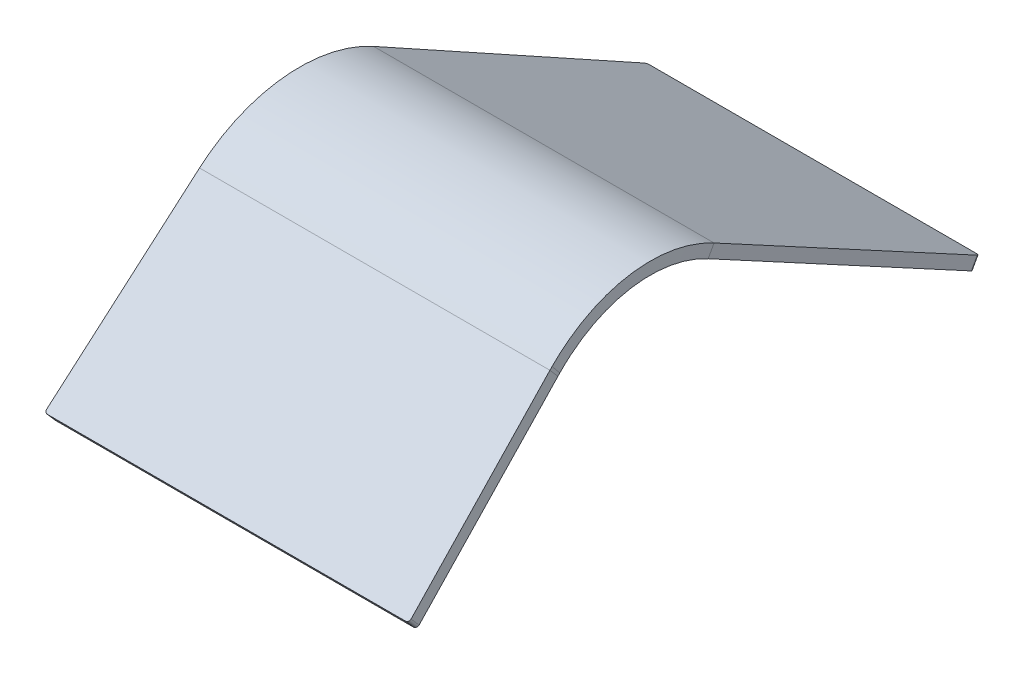
ISO-10303-21;
HEADER;
FILE_DESCRIPTION(('STEP AP214'),'2;1');
FILE_NAME('part.step','',(''),(''),'','','');
FILE_SCHEMA(('AUTOMOTIVE_DESIGN { 1 0 10303 214 1 1 1 1 }'));
ENDSEC;
DATA;
#1=APPLICATION_CONTEXT('core data for automotive mechanical design processes');
#2=APPLICATION_PROTOCOL_DEFINITION('international standard','automotive_design',2000,#1);
#3=PRODUCT_CONTEXT('',#1,'mechanical');
#4=PRODUCT('Part','Part','',(#3));
#5=PRODUCT_RELATED_PRODUCT_CATEGORY('part','',(#4));
#6=PRODUCT_DEFINITION_FORMATION('','',#4);
#7=PRODUCT_DEFINITION_CONTEXT('part definition',#1,'design');
#8=PRODUCT_DEFINITION('design','',#6,#7);
#9=PRODUCT_DEFINITION_SHAPE('','',#8);
#10=(LENGTH_UNIT() NAMED_UNIT(*) SI_UNIT(.MILLI.,.METRE.));
#11=(NAMED_UNIT(*) PLANE_ANGLE_UNIT() SI_UNIT($,.RADIAN.));
#12=(NAMED_UNIT(*) SI_UNIT($,.STERADIAN.) SOLID_ANGLE_UNIT());
#13=UNCERTAINTY_MEASURE_WITH_UNIT(LENGTH_MEASURE(1.E-05),#10,'distance_accuracy_value','');
#14=(GEOMETRIC_REPRESENTATION_CONTEXT(3) GLOBAL_UNCERTAINTY_ASSIGNED_CONTEXT((#13)) GLOBAL_UNIT_ASSIGNED_CONTEXT((#10,
#11,#12)) REPRESENTATION_CONTEXT('',''));
#15=CARTESIAN_POINT('',(0.,0.,0.));
#16=DIRECTION('',(0.,0.,1.));
#17=DIRECTION('',(1.,0.,0.));
#18=AXIS2_PLACEMENT_3D('',#15,#16,#17);
#19=CARTESIAN_POINT('',(150.,130.,235.));
#20=DIRECTION('',(0.,0.87503404241775,-0.484061385167266));
#21=DIRECTION('',(0.,0.484061385167266,0.87503404241775));
#22=AXIS2_PLACEMENT_3D('',#19,#20,#21);
#23=PLANE('',#22);
#24=DIRECTION('',(-1.,0.,0.));
#25=VECTOR('',#24,1.);
#26=CARTESIAN_POINT('',(150.,0.,0.));
#27=LINE('',#26,#25);
#28=CARTESIAN_POINT('',(65.7299312475215,0.,0.));
#29=VERTEX_POINT('',#28);
#30=CARTESIAN_POINT('',(-148.,0.,0.));
#31=VERTEX_POINT('',#30);
#32=EDGE_CURVE('E185',#29,#31,#27,.T.);
#33=ORIENTED_EDGE('',*,*,#32,.F.);
#34=CARTESIAN_POINT('',(65.7299312475215,0.968122770334512,1.75006808483551));
#35=DIRECTION('',(0.,0.87503404241775,-0.484061385167266));
#36=DIRECTION('',(0.,0.484061385167266,0.87503404241775));
#37=AXIS2_PLACEMENT_3D('',#34,#35,#36);
#38=CIRCLE('',#37,2.);
#39=CARTESIAN_POINT('',(67.7293180904833,0.944151944036353,1.70673620652723));
#40=VERTEX_POINT('',#39);
#41=EDGE_CURVE('E206',#29,#40,#38,.F.);
#42=ORIENTED_EDGE('',*,*,#41,.T.);
#43=DIRECTION('',(-0.024760110011603,-0.483912982344654,-0.874765775776874));
#44=VECTOR('',#43,1.);
#45=CARTESIAN_POINT('',(74.3790367037548,130.906626440031,236.638901641594));
#46=LINE('',#45,#44);
#47=CARTESIAN_POINT('',(72.7411209673421,98.8951091864612,178.771928144757));
#48=VERTEX_POINT('',#47);
#49=EDGE_CURVE('E156',#48,#40,#46,.T.);
#50=ORIENTED_EDGE('',*,*,#49,.F.);
#51=DIRECTION('',(-1.,0.,0.));
#52=VECTOR('',#51,1.);
#53=CARTESIAN_POINT('',(150.,98.8951091864612,178.771928144757));
#54=LINE('',#53,#52);
#55=CARTESIAN_POINT('',(-150.,98.8951091864612,178.771928144757));
#56=VERTEX_POINT('',#55);
#57=EDGE_CURVE('E256',#48,#56,#54,.T.);
#58=ORIENTED_EDGE('',*,*,#57,.T.);
#59=DIRECTION('',(0.,-0.484061385167266,-0.87503404241775));
#60=VECTOR('',#59,1.);
#61=CARTESIAN_POINT('',(-150.,130.,235.));
#62=LINE('',#61,#60);
#63=CARTESIAN_POINT('',(-150.,0.968122770334534,1.75006808483549));
#64=VERTEX_POINT('',#63);
#65=EDGE_CURVE('E264',#56,#64,#62,.T.);
#66=ORIENTED_EDGE('',*,*,#65,.T.);
#67=CARTESIAN_POINT('',(-148.,0.968122770334506,1.75006808483549));
#68=DIRECTION('',(0.,0.87503404241775,-0.484061385167266));
#69=DIRECTION('',(0.,0.484061385167266,0.87503404241775));
#70=AXIS2_PLACEMENT_3D('',#67,#68,#69);
#71=CIRCLE('',#70,2.);
#72=EDGE_CURVE('E204',#64,#31,#71,.F.);
#73=ORIENTED_EDGE('',*,*,#72,.T.);
#74=EDGE_LOOP('',(#33,#42,#50,#58,#66,#73));
#75=FACE_BOUND('',#74,.T.);
#76=ADVANCED_FACE('F47',(#75),#23,.F.);
#77=CARTESIAN_POINT('',(150.,7.00027233934195,-3.87249108133825));
#78=DIRECTION('',(0.,-0.48406138516728,-0.875034042417742));
#79=DIRECTION('',(0.,0.875034042417742,-0.48406138516728));
#80=AXIS2_PLACEMENT_3D('',#77,#78,#79);
#81=PLANE('',#80);
#82=DIRECTION('',(-1.,0.,0.));
#83=VECTOR('',#82,1.);
#84=CARTESIAN_POINT('',(150.,7.00027233934195,-3.87249108133825));
#85=LINE('',#84,#83);
#86=CARTESIAN_POINT('',(65.7299312475215,7.00027233934195,-3.87249108133825));
#87=VERTEX_POINT('',#86);
#88=CARTESIAN_POINT('',(-148.,7.00027233934195,-3.87249108133825));
#89=VERTEX_POINT('',#88);
#90=EDGE_CURVE('E181',#87,#89,#85,.T.);
#91=ORIENTED_EDGE('',*,*,#90,.F.);
#92=DIRECTION('',(0.,-0.875034042417742,0.48406138516728));
#93=VECTOR('',#92,1.);
#94=CARTESIAN_POINT('',(65.7299312475215,7.00027233934192,-3.87249108133823));
#95=LINE('',#94,#93);
#96=EDGE_CURVE('E201',#87,#29,#95,.T.);
#97=ORIENTED_EDGE('',*,*,#96,.T.);
#98=ORIENTED_EDGE('',*,*,#32,.T.);
#99=DIRECTION('',(0.,-0.875034042417742,0.48406138516728));
#100=VECTOR('',#99,1.);
#101=CARTESIAN_POINT('',(-148.,7.00027233934195,-3.87249108133825));
#102=LINE('',#101,#100);
#103=EDGE_CURVE('E199',#31,#89,#102,.F.);
#104=ORIENTED_EDGE('',*,*,#103,.T.);
#105=EDGE_LOOP('',(#91,#97,#98,#104));
#106=FACE_BOUND('',#105,.T.);
#107=ADVANCED_FACE('F309',(#106),#81,.T.);
#108=CARTESIAN_POINT('',(150.,137.000272339342,231.127508918662));
#109=DIRECTION('',(0.,0.87503404241775,-0.484061385167266));
#110=DIRECTION('',(0.,0.484061385167266,0.87503404241775));
#111=AXIS2_PLACEMENT_3D('',#108,#109,#110);
#112=PLANE('',#111);
#113=DIRECTION('',(-0.024760110011603,-0.483912982344654,-0.874765775776874));
#114=VECTOR('',#113,1.);
#115=CARTESIAN_POINT('',(74.3790367037548,137.906898779373,232.766410560256));
#116=LINE('',#115,#114);
#117=CARTESIAN_POINT('',(72.7411209673421,105.895381525803,174.899437063419));
#118=VERTEX_POINT('',#117);
#119=CARTESIAN_POINT('',(67.7293180904833,7.94442428337827,-2.16575487481105));
#120=VERTEX_POINT('',#119);
#121=EDGE_CURVE('E159',#118,#120,#116,.T.);
#122=ORIENTED_EDGE('',*,*,#121,.T.);
#123=CARTESIAN_POINT('',(65.7299312475215,7.96839510967646,-2.12242299650274));
#124=DIRECTION('',(0.,0.87503404241775,-0.484061385167266));
#125=DIRECTION('',(0.,0.484061385167266,0.87503404241775));
#126=AXIS2_PLACEMENT_3D('',#123,#124,#125);
#127=CIRCLE('',#126,2.);
#128=EDGE_CURVE('E211',#120,#87,#127,.T.);
#129=ORIENTED_EDGE('',*,*,#128,.T.);
#130=ORIENTED_EDGE('',*,*,#90,.T.);
#131=CARTESIAN_POINT('',(-148.,7.96839510967648,-2.12242299650277));
#132=DIRECTION('',(0.,0.87503404241775,-0.484061385167266));
#133=DIRECTION('',(0.,0.484061385167266,0.87503404241775));
#134=AXIS2_PLACEMENT_3D('',#131,#132,#133);
#135=CIRCLE('',#134,2.);
#136=CARTESIAN_POINT('',(-150.,7.96839510967642,-2.12242299650284));
#137=VERTEX_POINT('',#136);
#138=EDGE_CURVE('E209',#89,#137,#135,.T.);
#139=ORIENTED_EDGE('',*,*,#138,.T.);
#140=DIRECTION('',(0.,-0.484061385167266,-0.87503404241775));
#141=VECTOR('',#140,1.);
#142=CARTESIAN_POINT('',(-150.,137.000272339342,231.127508918662));
#143=LINE('',#142,#141);
#144=CARTESIAN_POINT('',(-150.,105.895381525803,174.899437063419));
#145=VERTEX_POINT('',#144);
#146=EDGE_CURVE('E179',#145,#137,#143,.T.);
#147=ORIENTED_EDGE('',*,*,#146,.F.);
#148=DIRECTION('',(-1.,0.,0.));
#149=VECTOR('',#148,1.);
#150=CARTESIAN_POINT('',(150.,105.895381525803,174.899437063419));
#151=LINE('',#150,#149);
#152=EDGE_CURVE('E172',#118,#145,#151,.T.);
#153=ORIENTED_EDGE('',*,*,#152,.F.);
#154=EDGE_LOOP('',(#122,#129,#130,#139,#147,#153));
#155=FACE_BOUND('',#154,.T.);
#156=ADVANCED_FACE('F177',(#155),#112,.T.);
#157=CARTESIAN_POINT('',(150.,18.3919772840282,223.305575580145));
#158=DIRECTION('',(-1.,0.,0.));
#159=DIRECTION('',(0.,0.,1.));
#160=AXIS2_PLACEMENT_3D('',#157,#158,#159);
#161=CYLINDRICAL_SURFACE('',#160,100.);
#162=DIRECTION('',(-1.,0.,0.));
#163=VECTOR('',#162,1.);
#164=CARTESIAN_POINT('',(150.,93.96088556301,288.798629421929));
#165=LINE('',#164,#163);
#166=CARTESIAN_POINT('',(79.2261863664963,93.96088556301,288.79862942193));
#167=VERTEX_POINT('',#166);
#168=CARTESIAN_POINT('',(-150.,93.96088556301,288.798629421929));
#169=VERTEX_POINT('',#168);
#170=EDGE_CURVE('E182',#167,#169,#165,.T.);
#171=ORIENTED_EDGE('',*,*,#170,.F.);
#172=CARTESIAN_POINT('',(79.1008771547623,18.3919772840282,223.305575580145));
#173=DIRECTION('',(0.99803450670407,0.0400891174084973,-0.0481662339546275));
#174=DIRECTION('',(-0.0626667649393535,0.638461592132793,-0.767098215317501));
#175=AXIS2_PLACEMENT_3D('',#172,#173,#174);
#176=ELLIPSE('',#175,100.19693640678,100.);
#177=CARTESIAN_POINT('',(79.1008771547623,95.2528683819512,287.277471125246));
#178=VERTEX_POINT('',#177);
#179=EDGE_CURVE('E166',#167,#178,#176,.F.);
#180=ORIENTED_EDGE('',*,*,#179,.T.);
#181=CARTESIAN_POINT('',(79.1008771547623,18.3919772840282,223.305575580145));
#182=DIRECTION('',(0.997679060715675,0.0435596085109254,-0.0523359562429404));
#183=DIRECTION('',(-0.0680917895894069,0.638234206596377,-0.766825016363449));
#184=AXIS2_PLACEMENT_3D('',#181,#182,#183);
#185=ELLIPSE('',#184,100.232633857491,100.);
#186=EDGE_CURVE('E148',#178,#118,#185,.F.);
#187=ORIENTED_EDGE('',*,*,#186,.T.);
#188=ORIENTED_EDGE('',*,*,#152,.T.);
#189=CARTESIAN_POINT('',(-150.,18.3919772840282,223.305575580145));
#190=DIRECTION('',(1.,0.,0.));
#191=DIRECTION('',(0.,0.,-1.));
#192=AXIS2_PLACEMENT_3D('',#189,#190,#191);
#193=CIRCLE('',#192,100.);
#194=EDGE_CURVE('E261',#169,#145,#193,.F.);
#195=ORIENTED_EDGE('',*,*,#194,.F.);
#196=EDGE_LOOP('',(#171,#180,#187,#188,#195));
#197=FACE_BOUND('',#196,.T.);
#198=ADVANCED_FACE('F170',(#197),#161,.T.);
#199=CARTESIAN_POINT('',(150.,6.04551266231849,390.239444307343));
#200=DIRECTION('',(0.,0.755689082789817,0.654930538417842));
#201=DIRECTION('',(0.,-0.654930538417842,0.755689082789817));
#202=AXIS2_PLACEMENT_3D('',#199,#200,#201);
#203=PLANE('',#202);
#204=DIRECTION('',(0.,0.654930538417842,-0.755689082789818));
#205=VECTOR('',#204,1.);
#206=CARTESIAN_POINT('',(-150.,6.04551266231849,390.239444307343));
#207=LINE('',#206,#205);
#208=CARTESIAN_POINT('',(-150.,7.35537373915416,388.728066141763));
#209=VERTEX_POINT('',#208);
#210=EDGE_CURVE('E244',#209,#169,#207,.T.);
#211=ORIENTED_EDGE('',*,*,#210,.F.);
#212=CARTESIAN_POINT('',(-148.,7.35537373915417,388.728066141763));
#213=DIRECTION('',(0.,0.755689082789817,0.654930538417842));
#214=DIRECTION('',(0.,-0.654930538417842,0.755689082789817));
#215=AXIS2_PLACEMENT_3D('',#212,#213,#214);
#216=CIRCLE('',#215,2.);
#217=CARTESIAN_POINT('',(-148.,6.04551266231849,390.239444307343));
#218=VERTEX_POINT('',#217);
#219=EDGE_CURVE('E221',#209,#218,#216,.T.);
#220=ORIENTED_EDGE('',*,*,#219,.T.);
#221=DIRECTION('',(-1.,0.,0.));
#222=VECTOR('',#221,1.);
#223=CARTESIAN_POINT('',(150.,6.04551266231849,390.239444307343));
#224=LINE('',#223,#222);
#225=CARTESIAN_POINT('',(86.24488299932,6.04551266231849,390.239444307343));
#226=VERTEX_POINT('',#225);
#227=EDGE_CURVE('E188',#226,#218,#224,.T.);
#228=ORIENTED_EDGE('',*,*,#227,.F.);
#229=CARTESIAN_POINT('',(86.24488299932,7.35537373915417,388.728066141763));
#230=DIRECTION('',(0.,0.755689082789817,0.654930538417842));
#231=DIRECTION('',(0.,-0.654930538417842,0.755689082789817));
#232=AXIS2_PLACEMENT_3D('',#229,#230,#231);
#233=CIRCLE('',#232,2.);
#234=CARTESIAN_POINT('',(88.2402429630648,7.44454684334405,388.625174098467));
#235=VERTEX_POINT('',#234);
#236=EDGE_CURVE('E219',#226,#235,#233,.T.);
#237=ORIENTED_EDGE('',*,*,#236,.T.);
#238=DIRECTION('',(-0.0680782914820898,0.653411087696383,-0.753935870418903));
#239=VECTOR('',#238,1.);
#240=CARTESIAN_POINT('',(88.6715665537237,3.3047306055099,393.401885142122));
#241=LINE('',#240,#239);
#242=EDGE_CURVE('E270',#235,#167,#241,.T.);
#243=ORIENTED_EDGE('',*,*,#242,.T.);
#244=ORIENTED_EDGE('',*,*,#170,.T.);
#245=EDGE_LOOP('',(#211,#220,#228,#237,#243,#244));
#246=FACE_BOUND('',#245,.T.);
#247=ADVANCED_FACE('F249',(#246),#203,.T.);
#248=CARTESIAN_POINT('',(150.,0.,385.));
#249=DIRECTION('',(0.,-0.654930538417843,0.755689082789817));
#250=DIRECTION('',(0.,-0.755689082789817,-0.654930538417843));
#251=AXIS2_PLACEMENT_3D('',#248,#249,#250);
#252=PLANE('',#251);
#253=ORIENTED_EDGE('',*,*,#227,.T.);
#254=DIRECTION('',(0.,0.755689082789817,0.654930538417843));
#255=VECTOR('',#254,1.);
#256=CARTESIAN_POINT('',(-148.,0.,385.));
#257=LINE('',#256,#255);
#258=CARTESIAN_POINT('',(-148.,0.,385.));
#259=VERTEX_POINT('',#258);
#260=EDGE_CURVE('E68',#218,#259,#257,.F.);
#261=ORIENTED_EDGE('',*,*,#260,.T.);
#262=DIRECTION('',(-1.,0.,0.));
#263=VECTOR('',#262,1.);
#264=CARTESIAN_POINT('',(150.,0.,385.));
#265=LINE('',#264,#263);
#266=CARTESIAN_POINT('',(86.24488299932,0.,385.));
#267=VERTEX_POINT('',#266);
#268=EDGE_CURVE('E235',#267,#259,#265,.T.);
#269=ORIENTED_EDGE('',*,*,#268,.F.);
#270=DIRECTION('',(0.,0.755689082789817,0.654930538417843));
#271=VECTOR('',#270,1.);
#272=CARTESIAN_POINT('',(86.24488299932,0.,385.));
#273=LINE('',#272,#271);
#274=EDGE_CURVE('E223',#267,#226,#273,.T.);
#275=ORIENTED_EDGE('',*,*,#274,.T.);
#276=EDGE_LOOP('',(#253,#261,#269,#275));
#277=FACE_BOUND('',#276,.T.);
#278=ADVANCED_FACE('F250',(#277),#252,.T.);
#279=CARTESIAN_POINT('',(150.,0.,385.));
#280=DIRECTION('',(0.,0.755689082789817,0.654930538417842));
#281=DIRECTION('',(0.,-0.654930538417842,0.755689082789817));
#282=AXIS2_PLACEMENT_3D('',#279,#280,#281);
#283=PLANE('',#282);
#284=ORIENTED_EDGE('',*,*,#268,.T.);
#285=CARTESIAN_POINT('',(-148.,1.30986107683562,383.48862183442));
#286=DIRECTION('',(0.,0.755689082789817,0.654930538417842));
#287=DIRECTION('',(0.,-0.654930538417842,0.755689082789817));
#288=AXIS2_PLACEMENT_3D('',#285,#286,#287);
#289=CIRCLE('',#288,2.);
#290=CARTESIAN_POINT('',(-150.,1.30986107683562,383.48862183442));
#291=VERTEX_POINT('',#290);
#292=EDGE_CURVE('E55',#259,#291,#289,.F.);
#293=ORIENTED_EDGE('',*,*,#292,.T.);
#294=DIRECTION('',(0.,0.654930538417842,-0.755689082789818));
#295=VECTOR('',#294,1.);
#296=CARTESIAN_POINT('',(-150.,0.,385.));
#297=LINE('',#296,#295);
#298=CARTESIAN_POINT('',(-150.,87.9153729006915,283.559185114587));
#299=VERTEX_POINT('',#298);
#300=EDGE_CURVE('E233',#291,#299,#297,.T.);
#301=ORIENTED_EDGE('',*,*,#300,.T.);
#302=DIRECTION('',(-1.,0.,0.));
#303=VECTOR('',#302,1.);
#304=CARTESIAN_POINT('',(150.,87.9153729006915,283.559185114587));
#305=LINE('',#304,#303);
#306=CARTESIAN_POINT('',(79.2261863664963,87.9153729006915,283.559185114587));
#307=VERTEX_POINT('',#306);
#308=EDGE_CURVE('E252',#307,#299,#305,.T.);
#309=ORIENTED_EDGE('',*,*,#308,.F.);
#310=DIRECTION('',(-0.0680782914820898,0.653411087696383,-0.753935870418903));
#311=VECTOR('',#310,1.);
#312=CARTESIAN_POINT('',(88.6715665537237,-2.74078205680865,388.162440834779));
#313=LINE('',#312,#311);
#314=CARTESIAN_POINT('',(88.2402429630648,1.39903418102551,383.385729791124));
#315=VERTEX_POINT('',#314);
#316=EDGE_CURVE('E155',#315,#307,#313,.T.);
#317=ORIENTED_EDGE('',*,*,#316,.F.);
#318=CARTESIAN_POINT('',(86.24488299932,1.30986107683563,383.48862183442));
#319=DIRECTION('',(0.,0.755689082789817,0.654930538417842));
#320=DIRECTION('',(0.,-0.654930538417842,0.755689082789817));
#321=AXIS2_PLACEMENT_3D('',#318,#319,#320);
#322=CIRCLE('',#321,2.);
#323=EDGE_CURVE('E227',#315,#267,#322,.F.);
#324=ORIENTED_EDGE('',*,*,#323,.T.);
#325=EDGE_LOOP('',(#284,#293,#301,#309,#317,#324));
#326=FACE_BOUND('',#325,.T.);
#327=ADVANCED_FACE('F231',(#326),#283,.F.);
#328=CARTESIAN_POINT('',(150.,18.3919772840282,223.305575580145));
#329=DIRECTION('',(-1.,0.,0.));
#330=DIRECTION('',(0.,0.,1.));
#331=AXIS2_PLACEMENT_3D('',#328,#329,#330);
#332=CYLINDRICAL_SURFACE('',#331,92.);
#333=CARTESIAN_POINT('',(79.1008771547623,18.3919772840282,223.305575580145));
#334=DIRECTION('',(0.997679060715675,0.0435596085109254,-0.0523359562429404));
#335=DIRECTION('',(-0.0680917895894069,0.638234206596377,-0.766825016363449));
#336=AXIS2_PLACEMENT_3D('',#333,#334,#335);
#337=ELLIPSE('',#336,92.2140231488919,92.);
#338=CARTESIAN_POINT('',(79.1008771547625,89.1039970941154,282.15971948164));
#339=VERTEX_POINT('',#338);
#340=EDGE_CURVE('E274',#307,#339,#337,.F.);
#341=ORIENTED_EDGE('',*,*,#340,.F.);
#342=ORIENTED_EDGE('',*,*,#308,.T.);
#343=CARTESIAN_POINT('',(-150.,18.3919772840282,223.305575580145));
#344=DIRECTION('',(-1.,0.,0.));
#345=DIRECTION('',(0.,0.,1.));
#346=AXIS2_PLACEMENT_3D('',#343,#344,#345);
#347=CIRCLE('',#346,92.);
#348=EDGE_CURVE('E243',#299,#56,#347,.T.);
#349=ORIENTED_EDGE('',*,*,#348,.T.);
#350=ORIENTED_EDGE('',*,*,#57,.F.);
#351=CARTESIAN_POINT('',(79.1008771547623,18.3919772840282,223.305575580145));
#352=DIRECTION('',(0.997259599354234,0.0473274939482296,-0.0568629915886714));
#353=DIRECTION('',(-0.0739816970326649,0.637965869212384,-0.766502614623234));
#354=AXIS2_PLACEMENT_3D('',#351,#352,#353);
#355=ELLIPSE('',#354,92.2528096591637,92.);
#356=EDGE_CURVE('E151',#339,#48,#355,.F.);
#357=ORIENTED_EDGE('',*,*,#356,.F.);
#358=EDGE_LOOP('',(#341,#342,#349,#350,#357));
#359=FACE_BOUND('',#358,.T.);
#360=ADVANCED_FACE('F326',(#359),#332,.F.);
#361=CARTESIAN_POINT('',(-150.,98.8951091864612,178.771928144757));
#362=DIRECTION('',(-1.,0.,0.));
#363=DIRECTION('',(0.,0.,1.));
#364=AXIS2_PLACEMENT_3D('',#361,#362,#363);
#365=PLANE('',#364);
#366=DIRECTION('',(0.,0.875034042417748,-0.484061385167269));
#367=VECTOR('',#366,1.);
#368=CARTESIAN_POINT('',(-150.,98.8951091864612,178.771928144757));
#369=LINE('',#368,#367);
#370=EDGE_CURVE('E197',#56,#145,#369,.T.);
#371=ORIENTED_EDGE('',*,*,#370,.F.);
#372=ORIENTED_EDGE('',*,*,#348,.F.);
#373=DIRECTION('',(0.,-0.755689082789819,-0.65493053841784));
#374=VECTOR('',#373,1.);
#375=CARTESIAN_POINT('',(-150.,93.96088556301,288.798629421929));
#376=LINE('',#375,#374);
#377=EDGE_CURVE('E194',#169,#299,#376,.T.);
#378=ORIENTED_EDGE('',*,*,#377,.F.);
#379=ORIENTED_EDGE('',*,*,#194,.T.);
#380=EDGE_LOOP('',(#371,#372,#378,#379));
#381=FACE_BOUND('',#380,.T.);
#382=ADVANCED_FACE('F323',(#381),#365,.T.);
#383=CARTESIAN_POINT('',(-150.,93.96088556301,288.798629421929));
#384=DIRECTION('',(-1.,0.,0.));
#385=DIRECTION('',(0.,0.,1.));
#386=AXIS2_PLACEMENT_3D('',#383,#384,#385);
#387=PLANE('',#386);
#388=ORIENTED_EDGE('',*,*,#146,.T.);
#389=DIRECTION('',(0.,-0.875034042417742,0.48406138516728));
#390=VECTOR('',#389,1.);
#391=CARTESIAN_POINT('',(-150.,-49.4139669852702,29.6210113538945));
#392=LINE('',#391,#390);
#393=EDGE_CURVE('E213',#137,#64,#392,.T.);
#394=ORIENTED_EDGE('',*,*,#393,.T.);
#395=ORIENTED_EDGE('',*,*,#65,.F.);
#396=ORIENTED_EDGE('',*,*,#370,.T.);
#397=EDGE_LOOP('',(#388,#394,#395,#396));
#398=FACE_BOUND('',#397,.T.);
#399=ADVANCED_FACE('F320',(#398),#387,.T.);
#400=CARTESIAN_POINT('',(-150.,18.3919772840282,223.305575580145));
#401=DIRECTION('',(1.,0.,0.));
#402=DIRECTION('',(0.,0.,-1.));
#403=AXIS2_PLACEMENT_3D('',#400,#401,#402);
#404=PLANE('',#403);
#405=ORIENTED_EDGE('',*,*,#300,.F.);
#406=DIRECTION('',(0.,0.755689082789817,0.654930538417843));
#407=VECTOR('',#406,1.);
#408=CARTESIAN_POINT('',(-150.,7.35537373915417,388.728066141763));
#409=LINE('',#408,#407);
#410=EDGE_CURVE('E216',#291,#209,#409,.T.);
#411=ORIENTED_EDGE('',*,*,#410,.T.);
#412=ORIENTED_EDGE('',*,*,#210,.T.);
#413=ORIENTED_EDGE('',*,*,#377,.T.);
#414=EDGE_LOOP('',(#405,#411,#412,#413));
#415=FACE_BOUND('',#414,.T.);
#416=ADVANCED_FACE('F239',(#415),#404,.F.);
#417=CARTESIAN_POINT('',(88.6715665537237,-2.74078205680865,388.162440834779));
#418=DIRECTION('',(0.997679981872384,0.0445865520949319,-0.0514460216479983));
#419=DIRECTION('',(-0.0680782914820898,0.653411087696383,-0.753935870418903));
#420=AXIS2_PLACEMENT_3D('',#417,#418,#419);
#421=PLANE('',#420);
#422=ORIENTED_EDGE('',*,*,#242,.F.);
#423=DIRECTION('',(0.,0.755689082789817,0.654930538417843));
#424=VECTOR('',#423,1.);
#425=CARTESIAN_POINT('',(88.2402429630648,1.39903418102551,383.385729791124));
#426=LINE('',#425,#424);
#427=EDGE_CURVE('E13',#235,#315,#426,.F.);
#428=ORIENTED_EDGE('',*,*,#427,.T.);
#429=ORIENTED_EDGE('',*,*,#316,.T.);
#430=DIRECTION('',(0.,-0.755689082789817,-0.654930538417842));
#431=VECTOR('',#430,1.);
#432=CARTESIAN_POINT('',(79.2261863664963,87.9153729006915,283.559185114587));
#433=LINE('',#432,#431);
#434=EDGE_CURVE('E267',#307,#167,#433,.F.);
#435=ORIENTED_EDGE('',*,*,#434,.T.);
#436=EDGE_LOOP('',(#422,#428,#429,#435));
#437=FACE_BOUND('',#436,.T.);
#438=ADVANCED_FACE('F340',(#437),#421,.T.);
#439=CARTESIAN_POINT('',(74.3790367037548,137.906898779373,232.766410560256));
#440=DIRECTION('',(0.999693421480913,-0.0119854131491104,-0.0216659391541612));
#441=DIRECTION('',(-0.024760110011603,-0.483912982344654,-0.874765775776874));
#442=AXIS2_PLACEMENT_3D('',#439,#440,#441);
#443=PLANE('',#442);
#444=ORIENTED_EDGE('',*,*,#49,.T.);
#445=DIRECTION('',(0.,-0.875034042417742,0.48406138516728));
#446=VECTOR('',#445,1.);
#447=CARTESIAN_POINT('',(67.7293180904833,7.94442428337436,-2.16575487480888));
#448=LINE('',#447,#446);
#449=EDGE_CURVE('E162',#40,#120,#448,.F.);
#450=ORIENTED_EDGE('',*,*,#449,.T.);
#451=ORIENTED_EDGE('',*,*,#121,.F.);
#452=DIRECTION('',(0.,0.87503404241775,-0.484061385167266));
#453=VECTOR('',#452,1.);
#454=CARTESIAN_POINT('',(72.7411209673421,105.895381525803,174.899437063419));
#455=LINE('',#454,#453);
#456=EDGE_CURVE('E143',#118,#48,#455,.F.);
#457=ORIENTED_EDGE('',*,*,#456,.T.);
#458=EDGE_LOOP('',(#444,#450,#451,#457));
#459=FACE_BOUND('',#458,.T.);
#460=ADVANCED_FACE('F160',(#459),#443,.T.);
#461=CARTESIAN_POINT('',(72.8218592933153,82.3638728291293,146.444684482223));
#462=CARTESIAN_POINT('',(72.8218592933153,80.6579556145933,148.494308244834));
#463=CARTESIAN_POINT('',(72.8218592933153,78.9520384000573,150.543932007446));
#464=CARTESIAN_POINT('',(72.8218592933153,77.2461211855212,152.593555770057));
#465=CARTESIAN_POINT('',(72.8218592933153,-71.3579093667153,18.5008933920208));
#466=CARTESIAN_POINT('',(72.8218592933153,-68.9645790560288,23.9623515837041));
#467=CARTESIAN_POINT('',(72.8218592933153,-66.5712487453423,29.4238097753874));
#468=CARTESIAN_POINT('',(72.8218592933153,-64.1779184346558,34.8852679670707));
#469=CARTESIAN_POINT('',(85.3798950162094,-199.301700456918,172.222675587865));
#470=CARTESIAN_POINT('',(85.3798950162094,-193.496535717159,173.584886254326));
#471=CARTESIAN_POINT('',(85.3798950162094,-187.6913709774,174.947096920787));
#472=CARTESIAN_POINT('',(85.3798950162094,-181.886206237642,176.309307587248));
#473=CARTESIAN_POINT('',(85.3798950162094,-45.5799182610729,300.166466678068));
#474=CARTESIAN_POINT('',(85.3798950162094,-43.8740010465368,298.116842915456));
#475=CARTESIAN_POINT('',(85.3798950162094,-42.1680838320008,296.067219152845));
#476=CARTESIAN_POINT('',(85.3798950162094,-40.4621666174648,294.017595390234));
#477=CARTESIAN_POINT('',(85.3798950162094,108.141863934772,428.11025776827));
#478=CARTESIAN_POINT('',(85.3798950162094,105.748533624085,422.648799576587));
#479=CARTESIAN_POINT('',(85.3798950162094,103.355203313399,417.187341384903));
#480=CARTESIAN_POINT('',(85.3798950162094,100.961873002712,411.72588319322));
#481=CARTESIAN_POINT('',(72.8218592933153,236.085655024974,274.388475572425));
#482=CARTESIAN_POINT('',(72.8218592933153,230.280490285216,273.026264905965));
#483=CARTESIAN_POINT('',(72.8218592933153,224.475325545457,271.664054239504));
#484=CARTESIAN_POINT('',(72.8218592933153,218.670160805698,270.301843573043));
#485=CARTESIAN_POINT('',(72.8218592933153,82.3638728291293,146.444684482223));
#486=CARTESIAN_POINT('',(72.8218592933153,80.6579556145933,148.494308244834));
#487=CARTESIAN_POINT('',(72.8218592933153,78.9520384000573,150.543932007446));
#488=CARTESIAN_POINT('',(72.8218592933153,77.2461211855212,152.593555770057));
#489=(BOUNDED_SURFACE() B_SPLINE_SURFACE(3,3,((#461,#462,#463,#464),(#465,#466,#467,#468),(#469,
#470,#471,#472),(#473,#474,#475,#476),(#477,#478,#479,#480),(#481,#482,#483,#484),(#485,#486,
#487,#488)),.UNSPECIFIED.,.T.,.F.,.F.) B_SPLINE_SURFACE_WITH_KNOTS((4,3,4),(4,4),(0.,0.5,1.),
(0.,1.),.UNSPECIFIED.) GEOMETRIC_REPRESENTATION_ITEM() RATIONAL_B_SPLINE_SURFACE(((1.,1.,1.,1.),
(0.333333333333333,0.333333333333333,0.333333333333333,0.333333333333333),(0.333333333333333,
0.333333333333333,0.333333333333333,0.333333333333333),(1.,1.,1.,1.),(0.333333333333333,
0.333333333333333,0.333333333333333,0.333333333333333),(0.333333333333333,0.333333333333333,
0.333333333333333,0.333333333333333),(1.,1.,1.,1.))) REPRESENTATION_ITEM('') SURFACE());
#490=CARTESIAN_POINT('',(79.1008771547624,89.1039970941162,282.159719481639));
#491=CARTESIAN_POINT('',(79.1008771547625,89.616403034768,282.586198785274));
#492=CARTESIAN_POINT('',(79.1008771547625,90.1288089754204,283.012678088909));
#493=CARTESIAN_POINT('',(79.1008771547626,91.1536208567255,283.865636696177));
#494=CARTESIAN_POINT('',(79.1008771547626,91.6660267973783,284.292115999811));
#495=CARTESIAN_POINT('',(79.1008771547626,92.6908386786837,285.14507460708));
#496=CARTESIAN_POINT('',(79.1008771547626,93.2032446193364,285.571553910714));
#497=CARTESIAN_POINT('',(79.1008771547626,94.2280565006425,286.424512517981));
#498=CARTESIAN_POINT('',(79.1008771547625,94.7404624412959,286.850991821615));
#499=CARTESIAN_POINT('',(79.1008771547624,95.2528683819502,287.277471125247));
#500=B_SPLINE_CURVE_WITH_KNOTS('',3,(#490,#491,#492,#493,#494,#495,#496,#497,#498,#499),
.UNSPECIFIED.,.F.,.F.,(4,2,2,2,4),(0.,2.00000000000002,4.00000000000002,5.99999999999999,
8.00000000000001),.UNSPECIFIED.);
#501=EDGE_CURVE('E276',#339,#178,#500,.T.);
#502=ORIENTED_EDGE('',*,*,#501,.T.);
#503=ORIENTED_EDGE('',*,*,#179,.F.);
#504=ORIENTED_EDGE('',*,*,#434,.F.);
#505=ORIENTED_EDGE('',*,*,#340,.T.);
#506=EDGE_LOOP('',(#502,#503,#504,#505));
#507=FACE_BOUND('',#506,.T.);
#508=ADVANCED_FACE('F285',(#507),#489,.F.);
#509=CARTESIAN_POINT('',(72.275857740146,82.3638728291293,146.444684482223));
#510=CARTESIAN_POINT('',(72.275857740146,80.6579556145933,148.494308244834));
#511=CARTESIAN_POINT('',(72.275857740146,78.9520384000573,150.543932007445));
#512=CARTESIAN_POINT('',(72.275857740146,77.2461211855212,152.593555770057));
#513=CARTESIAN_POINT('',(72.275857740146,-71.3579093667152,18.5008933920208));
#514=CARTESIAN_POINT('',(72.275857740146,-68.9645790560288,23.9623515837041));
#515=CARTESIAN_POINT('',(72.275857740146,-66.5712487453423,29.4238097753875));
#516=CARTESIAN_POINT('',(72.275857740146,-64.1779184346558,34.8852679670708));
#517=CARTESIAN_POINT('',(85.9258965693787,-199.301700456918,172.222675587865));
#518=CARTESIAN_POINT('',(85.9258965693787,-193.496535717159,173.584886254326));
#519=CARTESIAN_POINT('',(85.9258965693787,-187.6913709774,174.947096920787));
#520=CARTESIAN_POINT('',(85.9258965693787,-181.886206237642,176.309307587248));
#521=CARTESIAN_POINT('',(85.9258965693787,-45.5799182610729,300.166466678068));
#522=CARTESIAN_POINT('',(85.9258965693787,-43.8740010465368,298.116842915456));
#523=CARTESIAN_POINT('',(85.9258965693787,-42.1680838320008,296.067219152845));
#524=CARTESIAN_POINT('',(85.9258965693787,-40.4621666174648,294.017595390234));
#525=CARTESIAN_POINT('',(85.9258965693787,108.141863934772,428.11025776827));
#526=CARTESIAN_POINT('',(85.9258965693787,105.748533624085,422.648799576586));
#527=CARTESIAN_POINT('',(85.9258965693787,103.355203313399,417.187341384903));
#528=CARTESIAN_POINT('',(85.9258965693787,100.961873002712,411.72588319322));
#529=CARTESIAN_POINT('',(72.275857740146,236.085655024974,274.388475572425));
#530=CARTESIAN_POINT('',(72.275857740146,230.280490285215,273.026264905965));
#531=CARTESIAN_POINT('',(72.275857740146,224.475325545457,271.664054239504));
#532=CARTESIAN_POINT('',(72.275857740146,218.670160805698,270.301843573043));
#533=CARTESIAN_POINT('',(72.275857740146,82.3638728291293,146.444684482223));
#534=CARTESIAN_POINT('',(72.275857740146,80.6579556145933,148.494308244834));
#535=CARTESIAN_POINT('',(72.275857740146,78.9520384000573,150.543932007445));
#536=CARTESIAN_POINT('',(72.275857740146,77.2461211855212,152.593555770057));
#537=(BOUNDED_SURFACE() B_SPLINE_SURFACE(3,3,((#509,#510,#511,#512),(#513,#514,#515,#516),(#517,
#518,#519,#520),(#521,#522,#523,#524),(#525,#526,#527,#528),(#529,#530,#531,#532),(#533,#534,
#535,#536)),.UNSPECIFIED.,.T.,.F.,.F.) B_SPLINE_SURFACE_WITH_KNOTS((4,3,4),(4,4),(0.,0.5,1.),
(0.,1.),.UNSPECIFIED.) GEOMETRIC_REPRESENTATION_ITEM() RATIONAL_B_SPLINE_SURFACE(((1.,1.,1.,1.),
(0.333333333333333,0.333333333333333,0.333333333333333,0.333333333333333),(0.333333333333333,
0.333333333333333,0.333333333333333,0.333333333333333),(1.,1.,1.,1.),(0.333333333333333,
0.333333333333333,0.333333333333333,0.333333333333333),(0.333333333333333,0.333333333333333,
0.333333333333333,0.333333333333333),(1.,1.,1.,1.))) REPRESENTATION_ITEM('') SURFACE());
#538=ORIENTED_EDGE('',*,*,#356,.T.);
#539=ORIENTED_EDGE('',*,*,#456,.F.);
#540=ORIENTED_EDGE('',*,*,#186,.F.);
#541=ORIENTED_EDGE('',*,*,#501,.F.);
#542=EDGE_LOOP('',(#538,#539,#540,#541));
#543=FACE_BOUND('',#542,.T.);
#544=ADVANCED_FACE('F145',(#543),#537,.F.);
#545=CARTESIAN_POINT('',(65.7299312475215,7.96839510967648,-2.12242299650275));
#546=DIRECTION('',(0.,-0.875034042417742,0.48406138516728));
#547=DIRECTION('',(0.,-0.48406138516728,-0.875034042417742));
#548=AXIS2_PLACEMENT_3D('',#545,#546,#547);
#549=CYLINDRICAL_SURFACE('',#548,2.);
#550=ORIENTED_EDGE('',*,*,#128,.F.);
#551=ORIENTED_EDGE('',*,*,#449,.F.);
#552=ORIENTED_EDGE('',*,*,#41,.F.);
#553=ORIENTED_EDGE('',*,*,#96,.F.);
#554=EDGE_LOOP('',(#550,#551,#552,#553));
#555=FACE_BOUND('',#554,.T.);
#556=ADVANCED_FACE('F294',(#555),#549,.T.);
#557=CARTESIAN_POINT('',(-148.,-49.4139669852702,29.6210113538945));
#558=DIRECTION('',(0.,-0.875034042417742,0.48406138516728));
#559=DIRECTION('',(0.,-0.48406138516728,-0.875034042417742));
#560=AXIS2_PLACEMENT_3D('',#557,#558,#559);
#561=CYLINDRICAL_SURFACE('',#560,2.);
#562=ORIENTED_EDGE('',*,*,#138,.F.);
#563=ORIENTED_EDGE('',*,*,#103,.F.);
#564=ORIENTED_EDGE('',*,*,#72,.F.);
#565=ORIENTED_EDGE('',*,*,#393,.F.);
#566=EDGE_LOOP('',(#562,#563,#564,#565));
#567=FACE_BOUND('',#566,.T.);
#568=ADVANCED_FACE('F304',(#567),#561,.T.);
#569=CARTESIAN_POINT('',(-148.,-68.2135345398276,323.235012299979));
#570=DIRECTION('',(0.,-0.755689082789817,-0.654930538417843));
#571=DIRECTION('',(0.,0.654930538417843,-0.755689082789817));
#572=AXIS2_PLACEMENT_3D('',#569,#570,#571);
#573=CYLINDRICAL_SURFACE('',#572,2.);
#574=ORIENTED_EDGE('',*,*,#292,.F.);
#575=ORIENTED_EDGE('',*,*,#260,.F.);
#576=ORIENTED_EDGE('',*,*,#219,.F.);
#577=ORIENTED_EDGE('',*,*,#410,.F.);
#578=EDGE_LOOP('',(#574,#575,#576,#577));
#579=FACE_BOUND('',#578,.T.);
#580=ADVANCED_FACE('F246',(#579),#573,.T.);
#581=CARTESIAN_POINT('',(86.24488299932,1.30986107683564,383.48862183442));
#582=DIRECTION('',(0.,0.755689082789817,0.654930538417843));
#583=DIRECTION('',(0.,-0.654930538417843,0.755689082789817));
#584=AXIS2_PLACEMENT_3D('',#581,#582,#583);
#585=CYLINDRICAL_SURFACE('',#584,2.);
#586=ORIENTED_EDGE('',*,*,#323,.F.);
#587=ORIENTED_EDGE('',*,*,#427,.F.);
#588=ORIENTED_EDGE('',*,*,#236,.F.);
#589=ORIENTED_EDGE('',*,*,#274,.F.);
#590=EDGE_LOOP('',(#586,#587,#588,#589));
#591=FACE_BOUND('',#590,.T.);
#592=ADVANCED_FACE('F49',(#591),#585,.T.);
#593=CLOSED_SHELL('',(#76,#107,#156,#198,#247,#278,#327,#360,#382,#399,#416,#438,#460,#508,#544,
#556,#568,#580,#592));
#594=MANIFOLD_SOLID_BREP('B2',#593);
#595=ADVANCED_BREP_SHAPE_REPRESENTATION('',(#18,#594),#14);
#596=SHAPE_DEFINITION_REPRESENTATION(#9,#595);
ENDSEC;
END-ISO-10303-21;
